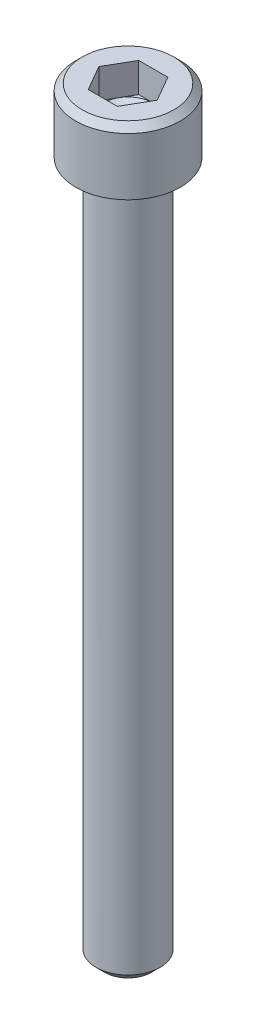
ISO-10303-21;
HEADER;
FILE_DESCRIPTION(('STEP AP214'),'2;1');
FILE_NAME('part.step','',(''),(''),'','','');
FILE_SCHEMA(('AUTOMOTIVE_DESIGN { 1 0 10303 214 1 1 1 1 }'));
ENDSEC;
DATA;
#1=APPLICATION_CONTEXT('core data for automotive mechanical design processes');
#2=APPLICATION_PROTOCOL_DEFINITION('international standard','automotive_design',2000,#1);
#3=PRODUCT_CONTEXT('',#1,'mechanical');
#4=PRODUCT('Part','Part','',(#3));
#5=PRODUCT_RELATED_PRODUCT_CATEGORY('part','',(#4));
#6=PRODUCT_DEFINITION_FORMATION('','',#4);
#7=PRODUCT_DEFINITION_CONTEXT('part definition',#1,'design');
#8=PRODUCT_DEFINITION('design','',#6,#7);
#9=PRODUCT_DEFINITION_SHAPE('','',#8);
#10=(LENGTH_UNIT() NAMED_UNIT(*) SI_UNIT(.MILLI.,.METRE.));
#11=(NAMED_UNIT(*) PLANE_ANGLE_UNIT() SI_UNIT($,.RADIAN.));
#12=(NAMED_UNIT(*) SI_UNIT($,.STERADIAN.) SOLID_ANGLE_UNIT());
#13=UNCERTAINTY_MEASURE_WITH_UNIT(LENGTH_MEASURE(1.E-05),#10,'distance_accuracy_value','');
#14=(GEOMETRIC_REPRESENTATION_CONTEXT(3) GLOBAL_UNCERTAINTY_ASSIGNED_CONTEXT((#13)) GLOBAL_UNIT_ASSIGNED_CONTEXT((#10,
#11,#12)) REPRESENTATION_CONTEXT('',''));
#15=CARTESIAN_POINT('',(0.,0.,0.));
#16=DIRECTION('',(0.,0.,1.));
#17=DIRECTION('',(1.,0.,0.));
#18=AXIS2_PLACEMENT_3D('',#15,#16,#17);
#19=CARTESIAN_POINT('',(0.,1.87959999988152,0.));
#20=DIRECTION('',(0.,1.,0.));
#21=DIRECTION('',(0.,0.,1.));
#22=AXIS2_PLACEMENT_3D('',#19,#20,#21);
#23=CONICAL_SURFACE('',#22,1.38429999981327,1.04719755105418);
#24=CARTESIAN_POINT('',(0.,1.08037402230821,-1.70530256582424E-10));
#25=VERTEX_POINT('',#24);
#26=VERTEX_LOOP('',#25);
#27=FACE_BOUND('',#26,.T.);
#28=CARTESIAN_POINT('',(0.,1.87959999997998,0.));
#29=DIRECTION('',(0.,1.,0.));
#30=DIRECTION('',(0.,0.,1.));
#31=AXIS2_PLACEMENT_3D('',#28,#29,#30);
#32=CIRCLE('',#31,1.3842999999838);
#33=CARTESIAN_POINT('',(-1.19883896645178,1.87959999998999,-0.692149999995953));
#34=VERTEX_POINT('',#33);
#35=CARTESIAN_POINT('',(0.,1.87959999998999,-1.3842999999919));
#36=VERTEX_POINT('',#35);
#37=EDGE_CURVE('E147',#34,#36,#32,.F.);
#38=ORIENTED_EDGE('',*,*,#37,.F.);
#39=CARTESIAN_POINT('',(0.,1.87959999997998,0.));
#40=DIRECTION('',(0.,1.,0.));
#41=DIRECTION('',(0.,0.,1.));
#42=AXIS2_PLACEMENT_3D('',#39,#40,#41);
#43=CIRCLE('',#42,1.3842999999838);
#44=CARTESIAN_POINT('',(-1.19883896645178,1.87959999998999,0.692149999995946));
#45=VERTEX_POINT('',#44);
#46=EDGE_CURVE('E94',#45,#34,#43,.F.);
#47=ORIENTED_EDGE('',*,*,#46,.F.);
#48=CARTESIAN_POINT('',(0.,1.87959999997998,0.));
#49=DIRECTION('',(0.,1.,0.));
#50=DIRECTION('',(0.,0.,1.));
#51=AXIS2_PLACEMENT_3D('',#48,#49,#50);
#52=CIRCLE('',#51,1.3842999999838);
#53=CARTESIAN_POINT('',(0.,1.87959999998999,1.3842999999919));
#54=VERTEX_POINT('',#53);
#55=EDGE_CURVE('E90',#54,#45,#52,.F.);
#56=ORIENTED_EDGE('',*,*,#55,.F.);
#57=CARTESIAN_POINT('',(0.,1.87959999997998,0.));
#58=DIRECTION('',(0.,1.,0.));
#59=DIRECTION('',(0.,0.,1.));
#60=AXIS2_PLACEMENT_3D('',#57,#58,#59);
#61=CIRCLE('',#60,1.3842999999838);
#62=CARTESIAN_POINT('',(1.19883896645178,1.87959999998999,0.692149999995948));
#63=VERTEX_POINT('',#62);
#64=EDGE_CURVE('E88',#63,#54,#61,.F.);
#65=ORIENTED_EDGE('',*,*,#64,.F.);
#66=CARTESIAN_POINT('',(0.,1.87959999997998,0.));
#67=DIRECTION('',(0.,1.,0.));
#68=DIRECTION('',(0.,0.,1.));
#69=AXIS2_PLACEMENT_3D('',#66,#67,#68);
#70=CIRCLE('',#69,1.3842999999838);
#71=CARTESIAN_POINT('',(1.19883896645178,1.87959999998999,-0.692149999995947));
#72=VERTEX_POINT('',#71);
#73=EDGE_CURVE('E18',#72,#63,#70,.F.);
#74=ORIENTED_EDGE('',*,*,#73,.F.);
#75=CARTESIAN_POINT('',(0.,1.87959999997998,0.));
#76=DIRECTION('',(0.,1.,0.));
#77=DIRECTION('',(0.,0.,1.));
#78=AXIS2_PLACEMENT_3D('',#75,#76,#77);
#79=CIRCLE('',#78,1.3842999999838);
#80=EDGE_CURVE('E105',#36,#72,#79,.F.);
#81=ORIENTED_EDGE('',*,*,#80,.F.);
#82=EDGE_LOOP('',(#38,#47,#56,#65,#74,#81));
#83=FACE_BOUND('',#82,.T.);
#84=ADVANCED_FACE('F15',(#27,#83),#23,.F.);
#85=CARTESIAN_POINT('',(0.,1.8796,0.));
#86=DIRECTION('',(0.,1.,0.));
#87=DIRECTION('',(0.,0.,1.));
#88=AXIS2_PLACEMENT_3D('',#85,#86,#87);
#89=PLANE('',#88);
#90=DIRECTION('',(0.500000000000001,0.,-0.866025403784438));
#91=VECTOR('',#90,1.);
#92=CARTESIAN_POINT('',(0.799225977639198,1.8796,1.3843));
#93=LINE('',#92,#91);
#94=CARTESIAN_POINT('',(1.5984519552784,1.8796,0.));
#95=VERTEX_POINT('',#94);
#96=EDGE_CURVE('E100',#63,#95,#93,.T.);
#97=ORIENTED_EDGE('',*,*,#96,.T.);
#98=DIRECTION('',(-0.499999999999999,0.,-0.866025403784439));
#99=VECTOR('',#98,1.);
#100=CARTESIAN_POINT('',(1.5984519552784,1.8796,0.));
#101=LINE('',#100,#99);
#102=EDGE_CURVE('E103',#95,#72,#101,.T.);
#103=ORIENTED_EDGE('',*,*,#102,.T.);
#104=ORIENTED_EDGE('',*,*,#73,.T.);
#105=EDGE_LOOP('',(#97,#103,#104));
#106=FACE_BOUND('',#105,.T.);
#107=ADVANCED_FACE('F98',(#106),#89,.T.);
#108=CARTESIAN_POINT('',(0.,1.8796,0.));
#109=DIRECTION('',(0.,1.,0.));
#110=DIRECTION('',(0.,0.,1.));
#111=AXIS2_PLACEMENT_3D('',#108,#109,#110);
#112=PLANE('',#111);
#113=DIRECTION('',(-0.499999999999999,0.,-0.866025403784439));
#114=VECTOR('',#113,1.);
#115=CARTESIAN_POINT('',(1.5984519552784,1.8796,0.));
#116=LINE('',#115,#114);
#117=CARTESIAN_POINT('',(0.799225977639201,1.8796,-1.3843));
#118=VERTEX_POINT('',#117);
#119=EDGE_CURVE('E114',#72,#118,#116,.T.);
#120=ORIENTED_EDGE('',*,*,#119,.T.);
#121=DIRECTION('',(-1.,0.,0.));
#122=VECTOR('',#121,1.);
#123=CARTESIAN_POINT('',(0.799225977639201,1.8796,-1.3843));
#124=LINE('',#123,#122);
#125=EDGE_CURVE('E154',#118,#36,#124,.T.);
#126=ORIENTED_EDGE('',*,*,#125,.T.);
#127=ORIENTED_EDGE('',*,*,#80,.T.);
#128=EDGE_LOOP('',(#120,#126,#127));
#129=FACE_BOUND('',#128,.T.);
#130=ADVANCED_FACE('F151',(#129),#112,.T.);
#131=CARTESIAN_POINT('',(0.,1.8796,0.));
#132=DIRECTION('',(0.,1.,0.));
#133=DIRECTION('',(0.,0.,1.));
#134=AXIS2_PLACEMENT_3D('',#131,#132,#133);
#135=PLANE('',#134);
#136=DIRECTION('',(-1.,0.,0.));
#137=VECTOR('',#136,1.);
#138=CARTESIAN_POINT('',(0.799225977639201,1.8796,-1.3843));
#139=LINE('',#138,#137);
#140=CARTESIAN_POINT('',(-0.799225977639195,1.8796,-1.3843));
#141=VERTEX_POINT('',#140);
#142=EDGE_CURVE('E159',#36,#141,#139,.T.);
#143=ORIENTED_EDGE('',*,*,#142,.T.);
#144=DIRECTION('',(-0.5,0.,0.866025403784438));
#145=VECTOR('',#144,1.);
#146=CARTESIAN_POINT('',(-0.799225977639195,1.8796,-1.3843));
#147=LINE('',#146,#145);
#148=EDGE_CURVE('E162',#141,#34,#147,.T.);
#149=ORIENTED_EDGE('',*,*,#148,.T.);
#150=ORIENTED_EDGE('',*,*,#37,.T.);
#151=EDGE_LOOP('',(#143,#149,#150));
#152=FACE_BOUND('',#151,.T.);
#153=ADVANCED_FACE('F158',(#152),#135,.T.);
#154=CARTESIAN_POINT('',(0.,1.8796,0.));
#155=DIRECTION('',(0.,1.,0.));
#156=DIRECTION('',(0.,0.,1.));
#157=AXIS2_PLACEMENT_3D('',#154,#155,#156);
#158=PLANE('',#157);
#159=DIRECTION('',(-0.5,0.,0.866025403784438));
#160=VECTOR('',#159,1.);
#161=CARTESIAN_POINT('',(-0.799225977639195,1.8796,-1.3843));
#162=LINE('',#161,#160);
#163=CARTESIAN_POINT('',(-1.5984519552784,1.8796,0.));
#164=VERTEX_POINT('',#163);
#165=EDGE_CURVE('E170',#34,#164,#162,.T.);
#166=ORIENTED_EDGE('',*,*,#165,.T.);
#167=DIRECTION('',(0.5,0.,0.866025403784439));
#168=VECTOR('',#167,1.);
#169=CARTESIAN_POINT('',(-1.5984519552784,1.8796,0.));
#170=LINE('',#169,#168);
#171=EDGE_CURVE('E229',#164,#45,#170,.T.);
#172=ORIENTED_EDGE('',*,*,#171,.T.);
#173=ORIENTED_EDGE('',*,*,#46,.T.);
#174=EDGE_LOOP('',(#166,#172,#173));
#175=FACE_BOUND('',#174,.T.);
#176=ADVANCED_FACE('F334',(#175),#158,.T.);
#177=CARTESIAN_POINT('',(0.,1.8796,0.));
#178=DIRECTION('',(0.,1.,0.));
#179=DIRECTION('',(0.,0.,1.));
#180=AXIS2_PLACEMENT_3D('',#177,#178,#179);
#181=PLANE('',#180);
#182=DIRECTION('',(1.,0.,0.));
#183=VECTOR('',#182,1.);
#184=CARTESIAN_POINT('',(-0.799225977639198,1.8796,1.3843));
#185=LINE('',#184,#183);
#186=CARTESIAN_POINT('',(0.799225977639198,1.8796,1.3843));
#187=VERTEX_POINT('',#186);
#188=EDGE_CURVE('E110',#54,#187,#185,.T.);
#189=ORIENTED_EDGE('',*,*,#188,.T.);
#190=DIRECTION('',(0.500000000000001,0.,-0.866025403784438));
#191=VECTOR('',#190,1.);
#192=CARTESIAN_POINT('',(0.799225977639198,1.8796,1.3843));
#193=LINE('',#192,#191);
#194=EDGE_CURVE('E107',#187,#63,#193,.T.);
#195=ORIENTED_EDGE('',*,*,#194,.T.);
#196=ORIENTED_EDGE('',*,*,#64,.T.);
#197=EDGE_LOOP('',(#189,#195,#196));
#198=FACE_BOUND('',#197,.T.);
#199=ADVANCED_FACE('F108',(#198),#181,.T.);
#200=CARTESIAN_POINT('',(0.,1.8796,0.));
#201=DIRECTION('',(0.,1.,0.));
#202=DIRECTION('',(0.,0.,1.));
#203=AXIS2_PLACEMENT_3D('',#200,#201,#202);
#204=PLANE('',#203);
#205=DIRECTION('',(0.5,0.,0.866025403784439));
#206=VECTOR('',#205,1.);
#207=CARTESIAN_POINT('',(-1.5984519552784,1.8796,0.));
#208=LINE('',#207,#206);
#209=CARTESIAN_POINT('',(-0.799225977639199,1.8796,1.3843));
#210=VERTEX_POINT('',#209);
#211=EDGE_CURVE('E166',#45,#210,#208,.T.);
#212=ORIENTED_EDGE('',*,*,#211,.T.);
#213=DIRECTION('',(1.,0.,0.));
#214=VECTOR('',#213,1.);
#215=CARTESIAN_POINT('',(-0.799225977639198,1.8796,1.3843));
#216=LINE('',#215,#214);
#217=EDGE_CURVE('E130',#210,#54,#216,.T.);
#218=ORIENTED_EDGE('',*,*,#217,.T.);
#219=ORIENTED_EDGE('',*,*,#55,.T.);
#220=EDGE_LOOP('',(#212,#218,#219));
#221=FACE_BOUND('',#220,.T.);
#222=ADVANCED_FACE('F328',(#221),#204,.T.);
#223=CARTESIAN_POINT('',(0.799225977639198,3.5052,1.3843));
#224=DIRECTION('',(0.866025403784438,0.,0.500000000000001));
#225=DIRECTION('',(0.500000000000001,0.,-0.866025403784438));
#226=AXIS2_PLACEMENT_3D('',#223,#224,#225);
#227=PLANE('',#226);
#228=DIRECTION('',(0.,1.,0.));
#229=VECTOR('',#228,1.);
#230=CARTESIAN_POINT('',(0.799225977639198,3.5052,1.3843));
#231=LINE('',#230,#229);
#232=CARTESIAN_POINT('',(0.799225977639198,3.5052,1.3843));
#233=VERTEX_POINT('',#232);
#234=EDGE_CURVE('E237',#187,#233,#231,.T.);
#235=ORIENTED_EDGE('',*,*,#234,.T.);
#236=DIRECTION('',(0.500000000000002,0.,-0.866025403784437));
#237=VECTOR('',#236,1.);
#238=CARTESIAN_POINT('',(0.799225977639198,3.5052,1.3843));
#239=LINE('',#238,#237);
#240=CARTESIAN_POINT('',(1.5984519552784,3.5052,0.));
#241=VERTEX_POINT('',#240);
#242=EDGE_CURVE('E127',#233,#241,#239,.T.);
#243=ORIENTED_EDGE('',*,*,#242,.T.);
#244=DIRECTION('',(0.,1.,0.));
#245=VECTOR('',#244,1.);
#246=CARTESIAN_POINT('',(1.5984519552784,3.5052,0.));
#247=LINE('',#246,#245);
#248=EDGE_CURVE('E118',#241,#95,#247,.F.);
#249=ORIENTED_EDGE('',*,*,#248,.T.);
#250=ORIENTED_EDGE('',*,*,#96,.F.);
#251=ORIENTED_EDGE('',*,*,#194,.F.);
#252=EDGE_LOOP('',(#235,#243,#249,#250,#251));
#253=FACE_BOUND('',#252,.T.);
#254=ADVANCED_FACE('F116',(#253),#227,.F.);
#255=CARTESIAN_POINT('',(1.5984519552784,3.5052,0.));
#256=DIRECTION('',(0.866025403784439,0.,-0.499999999999999));
#257=DIRECTION('',(-0.499999999999999,0.,-0.866025403784439));
#258=AXIS2_PLACEMENT_3D('',#255,#256,#257);
#259=PLANE('',#258);
#260=ORIENTED_EDGE('',*,*,#248,.F.);
#261=DIRECTION('',(-0.5,0.,-0.866025403784439));
#262=VECTOR('',#261,1.);
#263=CARTESIAN_POINT('',(1.5984519552784,3.5052,0.));
#264=LINE('',#263,#262);
#265=CARTESIAN_POINT('',(0.799225977639201,3.5052,-1.3843));
#266=VERTEX_POINT('',#265);
#267=EDGE_CURVE('E129',#241,#266,#264,.T.);
#268=ORIENTED_EDGE('',*,*,#267,.T.);
#269=DIRECTION('',(0.,1.,0.));
#270=VECTOR('',#269,1.);
#271=CARTESIAN_POINT('',(0.799225977639201,3.5052,-1.3843));
#272=LINE('',#271,#270);
#273=EDGE_CURVE('E178',#266,#118,#272,.F.);
#274=ORIENTED_EDGE('',*,*,#273,.T.);
#275=ORIENTED_EDGE('',*,*,#119,.F.);
#276=ORIENTED_EDGE('',*,*,#102,.F.);
#277=EDGE_LOOP('',(#260,#268,#274,#275,#276));
#278=FACE_BOUND('',#277,.T.);
#279=ADVANCED_FACE('F217',(#278),#259,.F.);
#280=CARTESIAN_POINT('',(0.799225977639201,3.5052,-1.3843));
#281=DIRECTION('',(0.,0.,-1.));
#282=DIRECTION('',(-1.,0.,0.));
#283=AXIS2_PLACEMENT_3D('',#280,#281,#282);
#284=PLANE('',#283);
#285=ORIENTED_EDGE('',*,*,#273,.F.);
#286=DIRECTION('',(1.,0.,0.));
#287=VECTOR('',#286,1.);
#288=CARTESIAN_POINT('',(0.,3.5052,-1.3843));
#289=LINE('',#288,#287);
#290=CARTESIAN_POINT('',(-0.799225977639195,3.5052,-1.3843));
#291=VERTEX_POINT('',#290);
#292=EDGE_CURVE('E188',#266,#291,#289,.F.);
#293=ORIENTED_EDGE('',*,*,#292,.T.);
#294=DIRECTION('',(0.,1.,0.));
#295=VECTOR('',#294,1.);
#296=CARTESIAN_POINT('',(-0.799225977639195,3.5052,-1.3843));
#297=LINE('',#296,#295);
#298=EDGE_CURVE('E167',#291,#141,#297,.F.);
#299=ORIENTED_EDGE('',*,*,#298,.T.);
#300=ORIENTED_EDGE('',*,*,#142,.F.);
#301=ORIENTED_EDGE('',*,*,#125,.F.);
#302=EDGE_LOOP('',(#285,#293,#299,#300,#301));
#303=FACE_BOUND('',#302,.T.);
#304=ADVANCED_FACE('F222',(#303),#284,.F.);
#305=CARTESIAN_POINT('',(-0.799225977639195,3.5052,-1.3843));
#306=DIRECTION('',(-0.866025403784438,0.,-0.5));
#307=DIRECTION('',(-0.5,0.,0.866025403784438));
#308=AXIS2_PLACEMENT_3D('',#305,#306,#307);
#309=PLANE('',#308);
#310=ORIENTED_EDGE('',*,*,#298,.F.);
#311=DIRECTION('',(-0.500000000000003,0.,0.866025403784437));
#312=VECTOR('',#311,1.);
#313=CARTESIAN_POINT('',(-0.799225977639195,3.5052,-1.3843));
#314=LINE('',#313,#312);
#315=CARTESIAN_POINT('',(-1.5984519552784,3.5052,0.));
#316=VERTEX_POINT('',#315);
#317=EDGE_CURVE('E186',#291,#316,#314,.T.);
#318=ORIENTED_EDGE('',*,*,#317,.T.);
#319=DIRECTION('',(0.,1.,0.));
#320=VECTOR('',#319,1.);
#321=CARTESIAN_POINT('',(-1.5984519552784,3.5052,0.));
#322=LINE('',#321,#320);
#323=EDGE_CURVE('E172',#316,#164,#322,.F.);
#324=ORIENTED_EDGE('',*,*,#323,.T.);
#325=ORIENTED_EDGE('',*,*,#165,.F.);
#326=ORIENTED_EDGE('',*,*,#148,.F.);
#327=EDGE_LOOP('',(#310,#318,#324,#325,#326));
#328=FACE_BOUND('',#327,.T.);
#329=ADVANCED_FACE('F171',(#328),#309,.F.);
#330=CARTESIAN_POINT('',(-1.5984519552784,3.5052,0.));
#331=DIRECTION('',(-0.866025403784439,0.,0.5));
#332=DIRECTION('',(0.5,0.,0.866025403784439));
#333=AXIS2_PLACEMENT_3D('',#330,#331,#332);
#334=PLANE('',#333);
#335=ORIENTED_EDGE('',*,*,#323,.F.);
#336=DIRECTION('',(0.500000000000001,0.,0.866025403784438));
#337=VECTOR('',#336,1.);
#338=CARTESIAN_POINT('',(-1.5984519552784,3.5052,0.));
#339=LINE('',#338,#337);
#340=CARTESIAN_POINT('',(-0.799225977639198,3.5052,1.3843));
#341=VERTEX_POINT('',#340);
#342=EDGE_CURVE('E33',#316,#341,#339,.T.);
#343=ORIENTED_EDGE('',*,*,#342,.T.);
#344=DIRECTION('',(0.,1.,0.));
#345=VECTOR('',#344,1.);
#346=CARTESIAN_POINT('',(-0.799225977639198,3.5052,1.3843));
#347=LINE('',#346,#345);
#348=EDGE_CURVE('E239',#341,#210,#347,.F.);
#349=ORIENTED_EDGE('',*,*,#348,.T.);
#350=ORIENTED_EDGE('',*,*,#211,.F.);
#351=ORIENTED_EDGE('',*,*,#171,.F.);
#352=EDGE_LOOP('',(#335,#343,#349,#350,#351));
#353=FACE_BOUND('',#352,.T.);
#354=ADVANCED_FACE('F227',(#353),#334,.F.);
#355=CARTESIAN_POINT('',(-0.799225977639198,3.5052,1.3843));
#356=DIRECTION('',(0.,0.,1.));
#357=DIRECTION('',(1.,0.,0.));
#358=AXIS2_PLACEMENT_3D('',#355,#356,#357);
#359=PLANE('',#358);
#360=ORIENTED_EDGE('',*,*,#348,.F.);
#361=DIRECTION('',(1.,0.,0.));
#362=VECTOR('',#361,1.);
#363=CARTESIAN_POINT('',(0.,3.5052,1.3843));
#364=LINE('',#363,#362);
#365=EDGE_CURVE('E143',#341,#233,#364,.T.);
#366=ORIENTED_EDGE('',*,*,#365,.T.);
#367=ORIENTED_EDGE('',*,*,#234,.F.);
#368=ORIENTED_EDGE('',*,*,#188,.F.);
#369=ORIENTED_EDGE('',*,*,#217,.F.);
#370=EDGE_LOOP('',(#360,#366,#367,#368,#369));
#371=FACE_BOUND('',#370,.T.);
#372=ADVANCED_FACE('F314',(#371),#359,.F.);
#373=CARTESIAN_POINT('',(0.,3.5052,0.));
#374=DIRECTION('',(0.,-1.,0.));
#375=DIRECTION('',(0.,0.,-1.));
#376=AXIS2_PLACEMENT_3D('',#373,#374,#375);
#377=PLANE('',#376);
#378=ORIENTED_EDGE('',*,*,#342,.F.);
#379=ORIENTED_EDGE('',*,*,#317,.F.);
#380=ORIENTED_EDGE('',*,*,#292,.F.);
#381=ORIENTED_EDGE('',*,*,#267,.F.);
#382=ORIENTED_EDGE('',*,*,#242,.F.);
#383=ORIENTED_EDGE('',*,*,#365,.F.);
#384=EDGE_LOOP('',(#378,#379,#380,#381,#382,#383));
#385=FACE_BOUND('',#384,.T.);
#386=CARTESIAN_POINT('',(0.,3.50519999994958,0.));
#387=DIRECTION('',(0.,-1.,0.));
#388=DIRECTION('',(0.,0.,-1.));
#389=AXIS2_PLACEMENT_3D('',#386,#387,#388);
#390=CIRCLE('',#389,2.51460000004045);
#391=CARTESIAN_POINT('',(0.,3.50519999994958,-2.51460000004045));
#392=VERTEX_POINT('',#391);
#393=EDGE_CURVE('E141',#392,#392,#390,.T.);
#394=ORIENTED_EDGE('',*,*,#393,.F.);
#395=EDGE_LOOP('',(#394));
#396=FACE_BOUND('',#395,.T.);
#397=ADVANCED_FACE('F224',(#385,#396),#377,.F.);
#398=CARTESIAN_POINT('',(0.,3.14960000002884,0.));
#399=DIRECTION('',(0.,-1.,0.));
#400=DIRECTION('',(0.,0.,-1.));
#401=AXIS2_PLACEMENT_3D('',#398,#399,#400);
#402=CONICAL_SURFACE('',#401,2.87020000001803,0.785398163477374);
#403=CARTESIAN_POINT('',(0.,3.1496,0.));
#404=DIRECTION('',(0.,-1.,0.));
#405=DIRECTION('',(0.,0.,-1.));
#406=AXIS2_PLACEMENT_3D('',#403,#404,#405);
#407=CIRCLE('',#406,2.8702);
#408=CARTESIAN_POINT('',(0.,3.1496,-2.8702));
#409=VERTEX_POINT('',#408);
#410=EDGE_CURVE('E140',#409,#409,#407,.T.);
#411=ORIENTED_EDGE('',*,*,#410,.F.);
#412=EDGE_LOOP('',(#411));
#413=FACE_BOUND('',#412,.T.);
#414=ORIENTED_EDGE('',*,*,#393,.T.);
#415=EDGE_LOOP('',(#414));
#416=FACE_BOUND('',#415,.T.);
#417=ADVANCED_FACE('F307',(#413,#416),#402,.T.);
#418=CARTESIAN_POINT('',(0.,5.58546,0.));
#419=DIRECTION('',(0.,-1.,0.));
#420=DIRECTION('',(0.,0.,-1.));
#421=AXIS2_PLACEMENT_3D('',#418,#419,#420);
#422=CYLINDRICAL_SURFACE('',#421,2.8702);
#423=CARTESIAN_POINT('',(0.,0.,0.));
#424=DIRECTION('',(0.,-1.,0.));
#425=DIRECTION('',(0.,0.,-1.));
#426=AXIS2_PLACEMENT_3D('',#423,#424,#425);
#427=CIRCLE('',#426,2.8702);
#428=CARTESIAN_POINT('',(0.,0.,-2.8702));
#429=VERTEX_POINT('',#428);
#430=EDGE_CURVE('E137',#429,#429,#427,.T.);
#431=ORIENTED_EDGE('',*,*,#430,.F.);
#432=EDGE_LOOP('',(#431));
#433=FACE_BOUND('',#432,.T.);
#434=ORIENTED_EDGE('',*,*,#410,.T.);
#435=EDGE_LOOP('',(#434));
#436=FACE_BOUND('',#435,.T.);
#437=ADVANCED_FACE('F304',(#433,#436),#422,.T.);
#438=CARTESIAN_POINT('',(0.,0.,0.));
#439=DIRECTION('',(0.,-1.,0.));
#440=DIRECTION('',(0.,0.,-1.));
#441=AXIS2_PLACEMENT_3D('',#438,#439,#440);
#442=PLANE('',#441);
#443=CARTESIAN_POINT('',(0.,0.,0.));
#444=DIRECTION('',(0.,-1.,0.));
#445=DIRECTION('',(-1.,0.,-3.20523991131182E-11));
#446=AXIS2_PLACEMENT_3D('',#443,#444,#445);
#447=CIRCLE('',#446,2.0066);
#448=CARTESIAN_POINT('',(-2.0066,0.,-6.43163440603831E-11));
#449=VERTEX_POINT('',#448);
#450=EDGE_CURVE('E136',#449,#449,#447,.F.);
#451=ORIENTED_EDGE('',*,*,#450,.T.);
#452=EDGE_LOOP('',(#451));
#453=FACE_BOUND('',#452,.T.);
#454=ORIENTED_EDGE('',*,*,#430,.T.);
#455=EDGE_LOOP('',(#454));
#456=FACE_BOUND('',#455,.T.);
#457=ADVANCED_FACE('F295',(#453,#456),#442,.T.);
#458=CARTESIAN_POINT('',(0.,-38.1,0.));
#459=DIRECTION('',(0.,-1.,0.));
#460=DIRECTION('',(0.,0.,-1.));
#461=AXIS2_PLACEMENT_3D('',#458,#459,#460);
#462=PLANE('',#461);
#463=CARTESIAN_POINT('',(0.,-38.0999999999858,0.));
#464=DIRECTION('',(0.,1.,0.));
#465=DIRECTION('',(0.,0.,1.));
#466=AXIS2_PLACEMENT_3D('',#463,#464,#465);
#467=CIRCLE('',#466,1.28016000002162);
#468=CARTESIAN_POINT('',(0.,-38.0999999999858,1.28016000002162));
#469=VERTEX_POINT('',#468);
#470=EDGE_CURVE('E133',#469,#469,#467,.T.);
#471=ORIENTED_EDGE('',*,*,#470,.F.);
#472=EDGE_LOOP('',(#471));
#473=FACE_BOUND('',#472,.T.);
#474=ADVANCED_FACE('F282',(#473),#462,.T.);
#475=CARTESIAN_POINT('',(0.,-0.254,0.));
#476=DIRECTION('',(0.,-1.,0.));
#477=DIRECTION('',(0.,0.,-1.));
#478=AXIS2_PLACEMENT_3D('',#475,#476,#477);
#479=TOROIDAL_SURFACE('',#478,2.0066,0.254);
#480=CARTESIAN_POINT('',(0.,-0.254,0.));
#481=DIRECTION('',(0.,-1.,0.));
#482=DIRECTION('',(0.,0.,-1.));
#483=AXIS2_PLACEMENT_3D('',#480,#481,#482);
#484=CIRCLE('',#483,1.7526);
#485=CARTESIAN_POINT('',(0.,-0.254,-1.7526));
#486=VERTEX_POINT('',#485);
#487=EDGE_CURVE('E24',#486,#486,#484,.T.);
#488=ORIENTED_EDGE('',*,*,#487,.F.);
#489=EDGE_LOOP('',(#488));
#490=FACE_BOUND('',#489,.T.);
#491=ORIENTED_EDGE('',*,*,#450,.F.);
#492=EDGE_LOOP('',(#491));
#493=FACE_BOUND('',#492,.T.);
#494=ADVANCED_FACE('F270',(#490,#493),#479,.F.);
#495=CARTESIAN_POINT('',(0.,-37.6275600000326,0.));
#496=DIRECTION('',(0.,1.,0.));
#497=DIRECTION('',(0.,0.,1.));
#498=AXIS2_PLACEMENT_3D('',#495,#496,#497);
#499=CONICAL_SURFACE('',#498,1.75259999997479,0.785398163397448);
#500=ORIENTED_EDGE('',*,*,#470,.T.);
#501=EDGE_LOOP('',(#500));
#502=FACE_BOUND('',#501,.T.);
#503=CARTESIAN_POINT('',(0.,-37.62756,0.));
#504=DIRECTION('',(0.,-1.,0.));
#505=DIRECTION('',(0.,0.,-1.));
#506=AXIS2_PLACEMENT_3D('',#503,#504,#505);
#507=CIRCLE('',#506,1.7526);
#508=CARTESIAN_POINT('',(0.,-37.62756,-1.7526));
#509=VERTEX_POINT('',#508);
#510=EDGE_CURVE('E10',#509,#509,#507,.F.);
#511=ORIENTED_EDGE('',*,*,#510,.F.);
#512=EDGE_LOOP('',(#511));
#513=FACE_BOUND('',#512,.T.);
#514=ADVANCED_FACE('F281',(#502,#513),#499,.T.);
#515=CARTESIAN_POINT('',(0.,5.58546,0.));
#516=DIRECTION('',(0.,-1.,0.));
#517=DIRECTION('',(0.,0.,-1.));
#518=AXIS2_PLACEMENT_3D('',#515,#516,#517);
#519=CYLINDRICAL_SURFACE('',#518,1.7526);
#520=ORIENTED_EDGE('',*,*,#510,.T.);
#521=EDGE_LOOP('',(#520));
#522=FACE_BOUND('',#521,.T.);
#523=ORIENTED_EDGE('',*,*,#487,.T.);
#524=EDGE_LOOP('',(#523));
#525=FACE_BOUND('',#524,.T.);
#526=ADVANCED_FACE('F346',(#522,#525),#519,.T.);
#527=CLOSED_SHELL('',(#84,#107,#130,#153,#176,#199,#222,#254,#279,#304,#329,#354,#372,#397,#417,
#437,#457,#474,#494,#514,#526));
#528=MANIFOLD_SOLID_BREP('B1',#527);
#529=ADVANCED_BREP_SHAPE_REPRESENTATION('',(#18,#528),#14);
#530=SHAPE_DEFINITION_REPRESENTATION(#9,#529);
ENDSEC;
END-ISO-10303-21;
